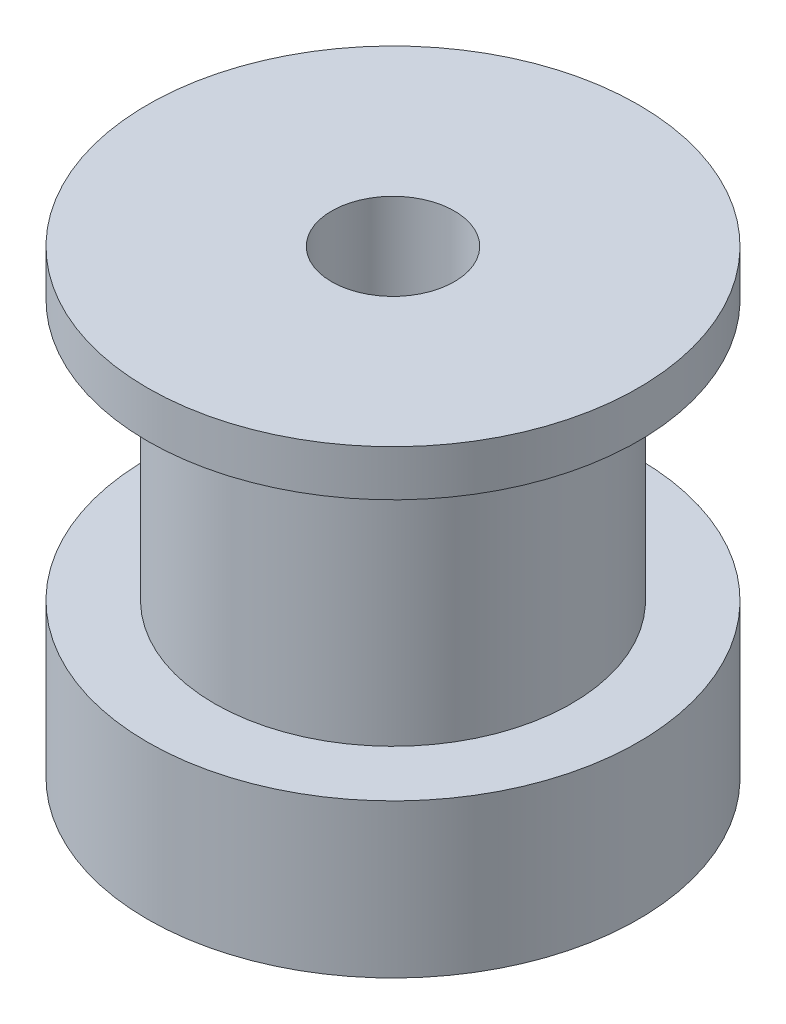
ISO-10303-21;
HEADER;
FILE_DESCRIPTION(('STEP AP214'),'2;1');
FILE_NAME('part.step','',(''),(''),'','','');
FILE_SCHEMA(('AUTOMOTIVE_DESIGN { 1 0 10303 214 1 1 1 1 }'));
ENDSEC;
DATA;
#1=APPLICATION_CONTEXT('core data for automotive mechanical design processes');
#2=APPLICATION_PROTOCOL_DEFINITION('international standard','automotive_design',2000,#1);
#3=PRODUCT_CONTEXT('',#1,'mechanical');
#4=PRODUCT('Part','Part','',(#3));
#5=PRODUCT_RELATED_PRODUCT_CATEGORY('part','',(#4));
#6=PRODUCT_DEFINITION_FORMATION('','',#4);
#7=PRODUCT_DEFINITION_CONTEXT('part definition',#1,'design');
#8=PRODUCT_DEFINITION('design','',#6,#7);
#9=PRODUCT_DEFINITION_SHAPE('','',#8);
#10=(LENGTH_UNIT() NAMED_UNIT(*) SI_UNIT(.MILLI.,.METRE.));
#11=(NAMED_UNIT(*) PLANE_ANGLE_UNIT() SI_UNIT($,.RADIAN.));
#12=(NAMED_UNIT(*) SI_UNIT($,.STERADIAN.) SOLID_ANGLE_UNIT());
#13=UNCERTAINTY_MEASURE_WITH_UNIT(LENGTH_MEASURE(1.E-05),#10,'distance_accuracy_value','');
#14=(GEOMETRIC_REPRESENTATION_CONTEXT(3) GLOBAL_UNCERTAINTY_ASSIGNED_CONTEXT((#13)) GLOBAL_UNIT_ASSIGNED_CONTEXT((#10,
#11,#12)) REPRESENTATION_CONTEXT('',''));
#15=CARTESIAN_POINT('',(0.,0.,0.));
#16=DIRECTION('',(0.,0.,1.));
#17=DIRECTION('',(1.,0.,0.));
#18=AXIS2_PLACEMENT_3D('',#15,#16,#17);
#19=CARTESIAN_POINT('',(0.,5.,0.));
#20=DIRECTION('',(0.,1.,0.));
#21=DIRECTION('',(0.,0.,1.));
#22=AXIS2_PLACEMENT_3D('',#19,#20,#21);
#23=PLANE('',#22);
#24=CARTESIAN_POINT('',(0.,5.,0.));
#25=DIRECTION('',(0.,1.,0.));
#26=DIRECTION('',(0.,0.,1.));
#27=AXIS2_PLACEMENT_3D('',#24,#25,#26);
#28=CIRCLE('',#27,8.);
#29=CARTESIAN_POINT('',(0.,5.,8.));
#30=VERTEX_POINT('',#29);
#31=EDGE_CURVE('E12',#30,#30,#28,.T.);
#32=ORIENTED_EDGE('',*,*,#31,.T.);
#33=EDGE_LOOP('',(#32));
#34=FACE_BOUND('',#33,.T.);
#35=CARTESIAN_POINT('',(0.,5.,0.));
#36=DIRECTION('',(0.,1.,0.));
#37=DIRECTION('',(0.,0.,1.));
#38=AXIS2_PLACEMENT_3D('',#35,#36,#37);
#39=CIRCLE('',#38,5.82);
#40=CARTESIAN_POINT('',(0.,5.,5.82));
#41=VERTEX_POINT('',#40);
#42=EDGE_CURVE('E118',#41,#41,#39,.F.);
#43=ORIENTED_EDGE('',*,*,#42,.T.);
#44=EDGE_LOOP('',(#43));
#45=FACE_BOUND('',#44,.T.);
#46=ADVANCED_FACE('F46',(#34,#45),#23,.T.);
#47=CARTESIAN_POINT('',(0.,0.,0.));
#48=DIRECTION('',(0.,1.,0.));
#49=DIRECTION('',(0.,0.,1.));
#50=AXIS2_PLACEMENT_3D('',#47,#48,#49);
#51=PLANE('',#50);
#52=CARTESIAN_POINT('',(0.,0.,0.));
#53=DIRECTION('',(0.,1.,0.));
#54=DIRECTION('',(0.,0.,1.));
#55=AXIS2_PLACEMENT_3D('',#52,#53,#54);
#56=CIRCLE('',#55,2.);
#57=CARTESIAN_POINT('',(0.,0.,2.));
#58=VERTEX_POINT('',#57);
#59=EDGE_CURVE('E114',#58,#58,#56,.T.);
#60=ORIENTED_EDGE('',*,*,#59,.T.);
#61=EDGE_LOOP('',(#60));
#62=FACE_BOUND('',#61,.T.);
#63=CARTESIAN_POINT('',(0.,0.,0.));
#64=DIRECTION('',(0.,1.,0.));
#65=DIRECTION('',(0.,0.,1.));
#66=AXIS2_PLACEMENT_3D('',#63,#64,#65);
#67=CIRCLE('',#66,8.);
#68=CARTESIAN_POINT('',(0.,0.,8.));
#69=VERTEX_POINT('',#68);
#70=EDGE_CURVE('E50',#69,#69,#67,.T.);
#71=ORIENTED_EDGE('',*,*,#70,.F.);
#72=EDGE_LOOP('',(#71));
#73=FACE_BOUND('',#72,.T.);
#74=ADVANCED_FACE('F103',(#62,#73),#51,.F.);
#75=CARTESIAN_POINT('',(0.,5.,0.));
#76=DIRECTION('',(0.,-1.,0.));
#77=DIRECTION('',(0.,0.,-1.));
#78=AXIS2_PLACEMENT_3D('',#75,#76,#77);
#79=CYLINDRICAL_SURFACE('',#78,8.);
#80=CARTESIAN_POINT('',(-7.74596669241483,2.5,-2.));
#81=CARTESIAN_POINT('',(-7.74596880070288,2.38955939925874,-1.99999686287446));
#82=CARTESIAN_POINT('',(-7.74835444811678,2.27908408105718,-1.99082099639812));
#83=CARTESIAN_POINT('',(-7.75761489594051,2.06130593746119,-1.95441850037103));
#84=CARTESIAN_POINT('',(-7.76449230897304,1.95400499642545,-1.92718136539368));
#85=CARTESIAN_POINT('',(-7.7819097967692,1.74575716945026,-1.85559295970563));
#86=CARTESIAN_POINT('',(-7.79244514152366,1.64480227569144,-1.81126378228359));
#87=CARTESIAN_POINT('',(-7.81598553623007,1.4517513179681,-1.70681691300911));
#88=CARTESIAN_POINT('',(-7.82899069102791,1.35965563033583,-1.64669855084855));
#89=CARTESIAN_POINT('',(-7.856325730845,1.18491068379023,-1.51096674184951));
#90=CARTESIAN_POINT('',(-7.87067678098427,1.10248511971996,-1.43506951016324));
#91=CARTESIAN_POINT('',(-7.89890300412235,0.95139088451173,-1.27054565128053));
#92=CARTESIAN_POINT('',(-7.91277813253111,0.882723499502604,-1.18191783534425));
#93=CARTESIAN_POINT('',(-7.93872332416466,0.760179625894979,-0.992916160863164));
#94=CARTESIAN_POINT('',(-7.95076549920474,0.706522889470829,-0.892395660956096));
#95=CARTESIAN_POINT('',(-7.97144649540787,0.616952284677535,-0.68341054743421));
#96=CARTESIAN_POINT('',(-7.98008581867475,0.58103579846759,-0.574947108633552));
#97=CARTESIAN_POINT('',(-7.99283807078544,0.528681732337134,-0.355487007003329));
#98=CARTESIAN_POINT('',(-7.99703915075451,0.511864284538736,-0.244586175639181));
#99=CARTESIAN_POINT('',(-8.00074875285838,0.496993296579559,-0.0214630554102159));
#100=CARTESIAN_POINT('',(-8.00025796877363,0.498936982232322,0.0907590356304543));
#101=CARTESIAN_POINT('',(-7.99470475962828,0.521259880200117,0.310704494344774));
#102=CARTESIAN_POINT('',(-7.98974401872699,0.541229060043086,0.418472431202134));
#103=CARTESIAN_POINT('',(-7.97592669219883,0.5983770160388,0.629076494827372));
#104=CARTESIAN_POINT('',(-7.96706989918753,0.635556708301928,0.731912358740875));
#105=CARTESIAN_POINT('',(-7.94630007760717,0.726402056549653,0.930813407003612));
#106=CARTESIAN_POINT('',(-7.93436015756043,0.780213635729398,1.02680901953301));
#107=CARTESIAN_POINT('',(-7.90871923047719,0.902684543293007,1.20855124468098));
#108=CARTESIAN_POINT('',(-7.89501791721992,0.971346454848496,1.29429607017101));
#109=CARTESIAN_POINT('',(-7.86690971015616,1.1237669935859,1.45554807016991));
#110=CARTESIAN_POINT('',(-7.85249375620734,1.20788391387822,1.5307153581504));
#111=CARTESIAN_POINT('',(-7.82492034813365,1.3876799788322,1.66595275192604));
#112=CARTESIAN_POINT('',(-7.81176295284776,1.4833596635928,1.72602215209203));
#113=CARTESIAN_POINT('',(-7.78816397465319,1.68423202731917,1.8295762580452));
#114=CARTESIAN_POINT('',(-7.77773586980577,1.78946858425056,1.87297913394098));
#115=CARTESIAN_POINT('',(-7.76094912111966,2.00606837446116,1.94137124127268));
#116=CARTESIAN_POINT('',(-7.75458960648175,2.11743029118651,1.96636441310582));
#117=CARTESIAN_POINT('',(-7.74684284831312,2.3399676012185,1.99666371093214));
#118=CARTESIAN_POINT('',(-7.74532871274918,2.4510702346637,2.0024723791357));
#119=CARTESIAN_POINT('',(-7.74709874784831,2.67265754926253,1.99561359241244));
#120=CARTESIAN_POINT('',(-7.75038247681013,2.78314228636099,1.98294783827904));
#121=CARTESIAN_POINT('',(-7.76125665563648,2.99849141196377,1.93994037115013));
#122=CARTESIAN_POINT('',(-7.768775761875,3.10341818125668,1.9098912546254));
#123=CARTESIAN_POINT('',(-7.7872057461677,3.30674516628135,1.8332944653365));
#124=CARTESIAN_POINT('',(-7.79811702598891,3.40514460724427,1.78674483817004));
#125=CARTESIAN_POINT('',(-7.8223690967461,3.59475302229388,1.67741653434925));
#126=CARTESIAN_POINT('',(-7.83575334885313,3.68578307203448,1.6143374030685));
#127=CARTESIAN_POINT('',(-7.86333666457373,3.85615069024108,1.47412058586891));
#128=CARTESIAN_POINT('',(-7.87753586182776,3.93548633332006,1.39698058961088));
#129=CARTESIAN_POINT('',(-7.90557922425285,4.08224883405677,1.22852544196945));
#130=CARTESIAN_POINT('',(-7.91940561649468,4.14932805003905,1.13690390506319));
#131=CARTESIAN_POINT('',(-7.94477773290987,4.267148693561,0.943405365389351));
#132=CARTESIAN_POINT('',(-7.95632357603169,4.31789097328657,0.841528897915182));
#133=CARTESIAN_POINT('',(-7.9757609259065,4.40115682762235,0.631116403462182));
#134=CARTESIAN_POINT('',(-7.98367864017925,4.43381142750325,0.522634762055765));
#135=CARTESIAN_POINT('',(-7.99508234716634,4.48036826768673,0.301499520637615));
#136=CARTESIAN_POINT('',(-7.99856919514738,4.49427412699123,0.188846730082482));
#137=CARTESIAN_POINT('',(-8.00068338817612,4.50273517915108,-0.0341670528866453));
#138=CARTESIAN_POINT('',(-7.99943957759977,4.49780341819082,-0.144507653932042));
#139=CARTESIAN_POINT('',(-7.99251792914887,4.4699043454113,-0.3627349928295));
#140=CARTESIAN_POINT('',(-7.98684022314338,4.44693756997366,-0.470621803561856));
#141=CARTESIAN_POINT('',(-7.97170865707778,4.38389556045828,-0.680342071289547));
#142=CARTESIAN_POINT('',(-7.96227529004785,4.34391309337124,-0.782204989161725));
#143=CARTESIAN_POINT('',(-7.94062577827316,4.24805884196086,-0.977834106083248));
#144=CARTESIAN_POINT('',(-7.92840928277515,4.19218505465903,-1.07159928253127));
#145=CARTESIAN_POINT('',(-7.90214499360574,4.06456953200774,-1.25080385684661));
#146=CARTESIAN_POINT('',(-7.88806033883329,3.99247971419234,-1.33598997659667));
#147=CARTESIAN_POINT('',(-7.85981298114379,3.83515429604531,-1.49323004054701));
#148=CARTESIAN_POINT('',(-7.84565025934604,3.74991536777768,-1.56528065015318));
#149=CARTESIAN_POINT('',(-7.81854951691005,3.56679717162108,-1.69552405294366));
#150=CARTESIAN_POINT('',(-7.80563927346578,3.46871175326949,-1.75343323883276));
#151=CARTESIAN_POINT('',(-7.78287910989656,3.26388902025036,-1.85185379317094));
#152=CARTESIAN_POINT('',(-7.77302696466427,3.15715806781231,-1.8923778195043));
#153=CARTESIAN_POINT('',(-7.75903817501475,2.95884597632968,-1.94884505714201));
#154=CARTESIAN_POINT('',(-7.75417326006998,2.86821367122773,-1.96798634119376));
#155=CARTESIAN_POINT('',(-7.7476367716524,2.68506226200463,-1.99356458514354));
#156=CARTESIAN_POINT('',(-7.74596492578215,2.5925433195112,-2.0000026287435));
#157=CARTESIAN_POINT('',(-7.74596669241483,2.5,-2.));
#158=B_SPLINE_CURVE_WITH_KNOTS('',3,(#80,#81,#82,#83,#84,#85,#86,#87,#88,#89,#90,#91,#92,#93,
#94,#95,#96,#97,#98,#99,#100,#101,#102,#103,#104,#105,#106,#107,#108,#109,#110,#111,#112,#113,
#114,#115,#116,#117,#118,#119,#120,#121,#122,#123,#124,#125,#126,#127,#128,#129,#130,#131,#132,
#133,#134,#135,#136,#137,#138,#139,#140,#141,#142,#143,#144,#145,#146,#147,#148,#149,#150,#151,
#152,#153,#154,#155,#156,#157),.UNSPECIFIED.,.T.,.F.,(4,2,2,2,2,2,2,2,2,2,2,2,2,2,2,2,2,2,2,2,2,
2,2,2,2,2,2,2,2,2,2,2,2,2,2,2,2,2,4),(0.,0.330981953388909,0.662156593142933,0.992904581732817,
1.32366661404383,1.66099163354381,1.99834817183893,2.34041197118336,2.68242527877674,
3.01751000796277,3.35254518932816,3.68014610151158,4.00776445379829,4.33834299403556,
4.66897908375131,5.00856373257529,5.34816424959841,5.68941145606722,6.03058560103638,
6.36274859809374,6.69488101747041,7.02157924007365,7.34831617137134,7.68146276687326,
8.01466415108036,8.35620264772255,8.69772332575643,9.03673658245543,9.3756843912723,
9.70546756901965,10.0352409390158,10.3632390124777,10.6912784459046,11.0271767726566,
11.3631602525241,11.7054118182895,12.0474137709606,12.3247826174462,12.6021278008238),.UNSPECIFIED.);
#159=CARTESIAN_POINT('',(-7.74596669241483,2.5,-2.));
#160=VERTEX_POINT('',#159);
#161=EDGE_CURVE('E69',#160,#160,#158,.T.);
#162=ORIENTED_EDGE('',*,*,#161,.F.);
#163=EDGE_LOOP('',(#162));
#164=FACE_BOUND('',#163,.T.);
#165=ORIENTED_EDGE('',*,*,#31,.F.);
#166=EDGE_LOOP('',(#165));
#167=FACE_BOUND('',#166,.T.);
#168=ORIENTED_EDGE('',*,*,#70,.T.);
#169=EDGE_LOOP('',(#168));
#170=FACE_BOUND('',#169,.T.);
#171=ADVANCED_FACE('F48',(#164,#167,#170),#79,.T.);
#172=CARTESIAN_POINT('',(0.,5.,0.));
#173=DIRECTION('',(0.,-1.,0.));
#174=DIRECTION('',(0.,0.,-1.));
#175=AXIS2_PLACEMENT_3D('',#172,#173,#174);
#176=CYLINDRICAL_SURFACE('',#175,2.);
#177=CARTESIAN_POINT('',(0.,2.5,0.));
#178=DIRECTION('',(0.707106781186547,-0.707106781186547,0.));
#179=DIRECTION('',(0.707106781186547,0.707106781186547,0.));
#180=AXIS2_PLACEMENT_3D('',#177,#178,#179);
#181=ELLIPSE('',#180,2.82842712474619,2.);
#182=CARTESIAN_POINT('',(0.,2.5,-2.));
#183=VERTEX_POINT('',#182);
#184=CARTESIAN_POINT('',(0.,2.5,2.));
#185=VERTEX_POINT('',#184);
#186=EDGE_CURVE('E60',#183,#185,#181,.F.);
#187=ORIENTED_EDGE('',*,*,#186,.T.);
#188=CARTESIAN_POINT('',(0.,2.5,0.));
#189=DIRECTION('',(0.707106781186547,0.707106781186547,0.));
#190=DIRECTION('',(0.707106781186547,-0.707106781186547,0.));
#191=AXIS2_PLACEMENT_3D('',#188,#189,#190);
#192=ELLIPSE('',#191,2.82842712474619,2.);
#193=EDGE_CURVE('E62',#185,#183,#192,.F.);
#194=ORIENTED_EDGE('',*,*,#193,.T.);
#195=EDGE_LOOP('',(#187,#194));
#196=FACE_BOUND('',#195,.T.);
#197=ORIENTED_EDGE('',*,*,#59,.F.);
#198=EDGE_LOOP('',(#197));
#199=FACE_BOUND('',#198,.T.);
#200=CARTESIAN_POINT('',(0.,15.,0.));
#201=DIRECTION('',(0.,1.,0.));
#202=DIRECTION('',(0.,0.,1.));
#203=AXIS2_PLACEMENT_3D('',#200,#201,#202);
#204=CIRCLE('',#203,2.);
#205=CARTESIAN_POINT('',(0.,15.,2.));
#206=VERTEX_POINT('',#205);
#207=EDGE_CURVE('E72',#206,#206,#204,.T.);
#208=ORIENTED_EDGE('',*,*,#207,.T.);
#209=EDGE_LOOP('',(#208));
#210=FACE_BOUND('',#209,.T.);
#211=ADVANCED_FACE('F67',(#196,#199,#210),#176,.F.);
#212=CARTESIAN_POINT('',(0.,13.5,0.));
#213=DIRECTION('',(0.,-1.,0.));
#214=DIRECTION('',(0.,0.,-1.));
#215=AXIS2_PLACEMENT_3D('',#212,#213,#214);
#216=CYLINDRICAL_SURFACE('',#215,5.82);
#217=ORIENTED_EDGE('',*,*,#42,.F.);
#218=EDGE_LOOP('',(#217));
#219=FACE_BOUND('',#218,.T.);
#220=CARTESIAN_POINT('',(0.,13.5,0.));
#221=DIRECTION('',(0.,1.,0.));
#222=DIRECTION('',(0.,0.,1.));
#223=AXIS2_PLACEMENT_3D('',#220,#221,#222);
#224=CIRCLE('',#223,5.82);
#225=CARTESIAN_POINT('',(0.,13.5,5.82));
#226=VERTEX_POINT('',#225);
#227=EDGE_CURVE('E121',#226,#226,#224,.T.);
#228=ORIENTED_EDGE('',*,*,#227,.F.);
#229=EDGE_LOOP('',(#228));
#230=FACE_BOUND('',#229,.T.);
#231=ADVANCED_FACE('F89',(#219,#230),#216,.T.);
#232=CARTESIAN_POINT('',(0.,15.,0.));
#233=DIRECTION('',(0.,1.,0.));
#234=DIRECTION('',(0.,0.,1.));
#235=AXIS2_PLACEMENT_3D('',#232,#233,#234);
#236=PLANE('',#235);
#237=CARTESIAN_POINT('',(0.,15.,0.));
#238=DIRECTION('',(0.,1.,0.));
#239=DIRECTION('',(0.,0.,1.));
#240=AXIS2_PLACEMENT_3D('',#237,#238,#239);
#241=CIRCLE('',#240,8.);
#242=CARTESIAN_POINT('',(0.,15.,8.));
#243=VERTEX_POINT('',#242);
#244=EDGE_CURVE('E126',#243,#243,#241,.T.);
#245=ORIENTED_EDGE('',*,*,#244,.T.);
#246=EDGE_LOOP('',(#245));
#247=FACE_BOUND('',#246,.T.);
#248=ORIENTED_EDGE('',*,*,#207,.F.);
#249=EDGE_LOOP('',(#248));
#250=FACE_BOUND('',#249,.T.);
#251=ADVANCED_FACE('F85',(#247,#250),#236,.T.);
#252=CARTESIAN_POINT('',(0.,13.5,0.));
#253=DIRECTION('',(0.,1.,0.));
#254=DIRECTION('',(0.,0.,1.));
#255=AXIS2_PLACEMENT_3D('',#252,#253,#254);
#256=PLANE('',#255);
#257=ORIENTED_EDGE('',*,*,#227,.T.);
#258=EDGE_LOOP('',(#257));
#259=FACE_BOUND('',#258,.T.);
#260=CARTESIAN_POINT('',(0.,13.5,0.));
#261=DIRECTION('',(0.,1.,0.));
#262=DIRECTION('',(0.,0.,1.));
#263=AXIS2_PLACEMENT_3D('',#260,#261,#262);
#264=CIRCLE('',#263,8.);
#265=CARTESIAN_POINT('',(0.,13.5,8.));
#266=VERTEX_POINT('',#265);
#267=EDGE_CURVE('E127',#266,#266,#264,.T.);
#268=ORIENTED_EDGE('',*,*,#267,.F.);
#269=EDGE_LOOP('',(#268));
#270=FACE_BOUND('',#269,.T.);
#271=ADVANCED_FACE('F88',(#259,#270),#256,.F.);
#272=CARTESIAN_POINT('',(0.,15.,0.));
#273=DIRECTION('',(0.,-1.,0.));
#274=DIRECTION('',(0.,0.,-1.));
#275=AXIS2_PLACEMENT_3D('',#272,#273,#274);
#276=CYLINDRICAL_SURFACE('',#275,8.);
#277=ORIENTED_EDGE('',*,*,#244,.F.);
#278=EDGE_LOOP('',(#277));
#279=FACE_BOUND('',#278,.T.);
#280=ORIENTED_EDGE('',*,*,#267,.T.);
#281=EDGE_LOOP('',(#280));
#282=FACE_BOUND('',#281,.T.);
#283=ADVANCED_FACE('F84',(#279,#282),#276,.T.);
#284=CARTESIAN_POINT('',(-8.001,2.5,0.));
#285=DIRECTION('',(1.,0.,0.));
#286=DIRECTION('',(0.,0.,-1.));
#287=AXIS2_PLACEMENT_3D('',#284,#285,#286);
#288=CYLINDRICAL_SURFACE('',#287,2.);
#289=ORIENTED_EDGE('',*,*,#193,.F.);
#290=ORIENTED_EDGE('',*,*,#186,.F.);
#291=EDGE_LOOP('',(#289,#290));
#292=FACE_BOUND('',#291,.T.);
#293=ORIENTED_EDGE('',*,*,#161,.T.);
#294=EDGE_LOOP('',(#293));
#295=FACE_BOUND('',#294,.T.);
#296=ADVANCED_FACE('F63',(#292,#295),#288,.F.);
#297=CLOSED_SHELL('',(#46,#74,#171,#211,#231,#251,#271,#283,#296));
#298=MANIFOLD_SOLID_BREP('B2',#297);
#299=ADVANCED_BREP_SHAPE_REPRESENTATION('',(#18,#298),#14);
#300=SHAPE_DEFINITION_REPRESENTATION(#9,#299);
ENDSEC;
END-ISO-10303-21;
